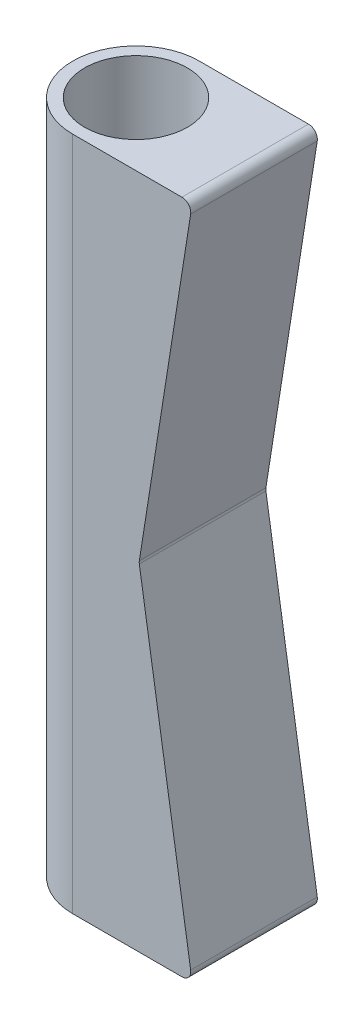
ISO-10303-21;
HEADER;
FILE_DESCRIPTION(('STEP AP214'),'2;1');
FILE_NAME('part.step','',(''),(''),'','','');
FILE_SCHEMA(('AUTOMOTIVE_DESIGN { 1 0 10303 214 1 1 1 1 }'));
ENDSEC;
DATA;
#1=APPLICATION_CONTEXT('core data for automotive mechanical design processes');
#2=APPLICATION_PROTOCOL_DEFINITION('international standard','automotive_design',2000,#1);
#3=PRODUCT_CONTEXT('',#1,'mechanical');
#4=PRODUCT('Part','Part','',(#3));
#5=PRODUCT_RELATED_PRODUCT_CATEGORY('part','',(#4));
#6=PRODUCT_DEFINITION_FORMATION('','',#4);
#7=PRODUCT_DEFINITION_CONTEXT('part definition',#1,'design');
#8=PRODUCT_DEFINITION('design','',#6,#7);
#9=PRODUCT_DEFINITION_SHAPE('','',#8);
#10=(LENGTH_UNIT() NAMED_UNIT(*) SI_UNIT(.MILLI.,.METRE.));
#11=(NAMED_UNIT(*) PLANE_ANGLE_UNIT() SI_UNIT($,.RADIAN.));
#12=(NAMED_UNIT(*) SI_UNIT($,.STERADIAN.) SOLID_ANGLE_UNIT());
#13=UNCERTAINTY_MEASURE_WITH_UNIT(LENGTH_MEASURE(1.E-05),#10,'distance_accuracy_value','');
#14=(GEOMETRIC_REPRESENTATION_CONTEXT(3) GLOBAL_UNCERTAINTY_ASSIGNED_CONTEXT((#13)) GLOBAL_UNIT_ASSIGNED_CONTEXT((#10,
#11,#12)) REPRESENTATION_CONTEXT('',''));
#15=CARTESIAN_POINT('',(0.,0.,0.));
#16=DIRECTION('',(0.,0.,1.));
#17=DIRECTION('',(1.,0.,0.));
#18=AXIS2_PLACEMENT_3D('',#15,#16,#17);
#19=CARTESIAN_POINT('',(0.,152.4,0.));
#20=DIRECTION('',(0.,-1.,0.));
#21=DIRECTION('',(0.,0.,-1.));
#22=AXIS2_PLACEMENT_3D('',#19,#20,#21);
#23=CYLINDRICAL_SURFACE('',#22,14.2875);
#24=DIRECTION('',(0.,1.,0.));
#25=VECTOR('',#24,1.);
#26=CARTESIAN_POINT('',(0.,0.,14.2875));
#27=LINE('',#26,#25);
#28=CARTESIAN_POINT('',(0.,0.,14.2875));
#29=VERTEX_POINT('',#28);
#30=CARTESIAN_POINT('',(0.,152.4,14.2875));
#31=VERTEX_POINT('',#30);
#32=EDGE_CURVE('E126',#29,#31,#27,.T.);
#33=ORIENTED_EDGE('',*,*,#32,.T.);
#34=CARTESIAN_POINT('',(0.,152.4,0.));
#35=DIRECTION('',(0.,1.,0.));
#36=DIRECTION('',(0.,0.,1.));
#37=AXIS2_PLACEMENT_3D('',#34,#35,#36);
#38=CIRCLE('',#37,14.2875);
#39=CARTESIAN_POINT('',(0.,152.4,-14.2875));
#40=VERTEX_POINT('',#39);
#41=EDGE_CURVE('E124',#40,#31,#38,.T.);
#42=ORIENTED_EDGE('',*,*,#41,.F.);
#43=DIRECTION('',(0.,1.,0.));
#44=VECTOR('',#43,1.);
#45=CARTESIAN_POINT('',(0.,0.,-14.2875));
#46=LINE('',#45,#44);
#47=CARTESIAN_POINT('',(0.,0.,-14.2875));
#48=VERTEX_POINT('',#47);
#49=EDGE_CURVE('E110',#48,#40,#46,.T.);
#50=ORIENTED_EDGE('',*,*,#49,.F.);
#51=CARTESIAN_POINT('',(0.,0.,0.));
#52=DIRECTION('',(0.,1.,0.));
#53=DIRECTION('',(0.,0.,1.));
#54=AXIS2_PLACEMENT_3D('',#51,#52,#53);
#55=CIRCLE('',#54,14.2875);
#56=EDGE_CURVE('E122',#48,#29,#55,.T.);
#57=ORIENTED_EDGE('',*,*,#56,.T.);
#58=EDGE_LOOP('',(#33,#42,#50,#57));
#59=FACE_BOUND('',#58,.T.);
#60=ADVANCED_FACE('F39',(#59),#23,.T.);
#61=CARTESIAN_POINT('',(0.,152.4,0.));
#62=DIRECTION('',(0.,1.,0.));
#63=DIRECTION('',(0.,0.,1.));
#64=AXIS2_PLACEMENT_3D('',#61,#62,#63);
#65=PLANE('',#64);
#66=DIRECTION('',(1.,0.,0.));
#67=VECTOR('',#66,1.);
#68=CARTESIAN_POINT('',(14.2875,152.4,14.2875));
#69=LINE('',#68,#67);
#70=CARTESIAN_POINT('',(24.6478912035075,152.4,14.2875));
#71=VERTEX_POINT('',#70);
#72=EDGE_CURVE('E117',#31,#71,#69,.T.);
#73=ORIENTED_EDGE('',*,*,#72,.T.);
#74=DIRECTION('',(0.,0.,-1.));
#75=VECTOR('',#74,1.);
#76=CARTESIAN_POINT('',(24.6478912035075,152.4,-14.2875));
#77=LINE('',#76,#75);
#78=CARTESIAN_POINT('',(24.6478912035075,152.4,-14.2875));
#79=VERTEX_POINT('',#78);
#80=EDGE_CURVE('E135',#71,#79,#77,.T.);
#81=ORIENTED_EDGE('',*,*,#80,.T.);
#82=DIRECTION('',(-1.,0.,0.));
#83=VECTOR('',#82,1.);
#84=CARTESIAN_POINT('',(14.2875,152.4,-14.2875));
#85=LINE('',#84,#83);
#86=EDGE_CURVE('E196',#79,#40,#85,.T.);
#87=ORIENTED_EDGE('',*,*,#86,.T.);
#88=ORIENTED_EDGE('',*,*,#41,.T.);
#89=EDGE_LOOP('',(#73,#81,#87,#88));
#90=FACE_BOUND('',#89,.T.);
#91=CARTESIAN_POINT('',(0.,152.4,0.));
#92=DIRECTION('',(0.,1.,0.));
#93=DIRECTION('',(0.,0.,1.));
#94=AXIS2_PLACEMENT_3D('',#91,#92,#93);
#95=CIRCLE('',#94,11.6125);
#96=CARTESIAN_POINT('',(0.,152.4,11.6125));
#97=VERTEX_POINT('',#96);
#98=EDGE_CURVE('E131',#97,#97,#95,.T.);
#99=ORIENTED_EDGE('',*,*,#98,.F.);
#100=EDGE_LOOP('',(#99));
#101=FACE_BOUND('',#100,.T.);
#102=ADVANCED_FACE('F224',(#90,#101),#65,.T.);
#103=CARTESIAN_POINT('',(0.,0.,0.));
#104=DIRECTION('',(0.,1.,0.));
#105=DIRECTION('',(0.,0.,1.));
#106=AXIS2_PLACEMENT_3D('',#103,#104,#105);
#107=PLANE('',#106);
#108=DIRECTION('',(-1.,0.,0.));
#109=VECTOR('',#108,1.);
#110=CARTESIAN_POINT('',(26.9875,0.,-14.2875));
#111=LINE('',#110,#109);
#112=CARTESIAN_POINT('',(24.6478912035075,0.,-14.2875));
#113=VERTEX_POINT('',#112);
#114=EDGE_CURVE('E106',#113,#48,#111,.T.);
#115=ORIENTED_EDGE('',*,*,#114,.F.);
#116=DIRECTION('',(0.,0.,-1.));
#117=VECTOR('',#116,1.);
#118=CARTESIAN_POINT('',(24.6478912035075,0.,0.));
#119=LINE('',#118,#117);
#120=CARTESIAN_POINT('',(24.6478912035075,0.,14.2875));
#121=VERTEX_POINT('',#120);
#122=EDGE_CURVE('E55',#113,#121,#119,.F.);
#123=ORIENTED_EDGE('',*,*,#122,.T.);
#124=DIRECTION('',(1.,0.,0.));
#125=VECTOR('',#124,1.);
#126=CARTESIAN_POINT('',(14.2875,0.,14.2875));
#127=LINE('',#126,#125);
#128=EDGE_CURVE('E116',#29,#121,#127,.T.);
#129=ORIENTED_EDGE('',*,*,#128,.F.);
#130=ORIENTED_EDGE('',*,*,#56,.F.);
#131=EDGE_LOOP('',(#115,#123,#129,#130));
#132=FACE_BOUND('',#131,.T.);
#133=CARTESIAN_POINT('',(0.,0.,0.));
#134=DIRECTION('',(0.,1.,0.));
#135=DIRECTION('',(0.,0.,1.));
#136=AXIS2_PLACEMENT_3D('',#133,#134,#135);
#137=CIRCLE('',#136,11.6125);
#138=CARTESIAN_POINT('',(0.,0.,11.6125));
#139=VERTEX_POINT('',#138);
#140=EDGE_CURVE('E138',#139,#139,#137,.T.);
#141=ORIENTED_EDGE('',*,*,#140,.T.);
#142=EDGE_LOOP('',(#141));
#143=FACE_BOUND('',#142,.T.);
#144=ADVANCED_FACE('F128',(#132,#143),#107,.F.);
#145=CARTESIAN_POINT('',(0.,152.4,0.));
#146=DIRECTION('',(0.,-1.,0.));
#147=DIRECTION('',(0.,0.,-1.));
#148=AXIS2_PLACEMENT_3D('',#145,#146,#147);
#149=CYLINDRICAL_SURFACE('',#148,11.6125);
#150=ORIENTED_EDGE('',*,*,#98,.T.);
#151=EDGE_LOOP('',(#150));
#152=FACE_BOUND('',#151,.T.);
#153=ORIENTED_EDGE('',*,*,#140,.F.);
#154=EDGE_LOOP('',(#153));
#155=FACE_BOUND('',#154,.T.);
#156=ADVANCED_FACE('F215',(#152,#155),#149,.F.);
#157=CARTESIAN_POINT('',(14.2875,0.,14.2875));
#158=DIRECTION('',(0.,0.,1.));
#159=DIRECTION('',(1.,0.,0.));
#160=AXIS2_PLACEMENT_3D('',#157,#158,#159);
#161=PLANE('',#160);
#162=DIRECTION('',(-0.155563141844365,-0.987825950711718,0.));
#163=VECTOR('',#162,1.);
#164=CARTESIAN_POINT('',(14.9875,76.2,14.2875));
#165=LINE('',#164,#163);
#166=CARTESIAN_POINT('',(26.6235431049309,150.088873716311,14.2875));
#167=VERTEX_POINT('',#166);
#168=CARTESIAN_POINT('',(15.0364962651478,76.5111262836888,14.2875));
#169=VERTEX_POINT('',#168);
#170=EDGE_CURVE('E174',#167,#169,#165,.T.);
#171=ORIENTED_EDGE('',*,*,#170,.F.);
#172=CARTESIAN_POINT('',(24.6478912035075,150.4,14.2875));
#173=DIRECTION('',(0.,0.,1.));
#174=DIRECTION('',(1.,0.,0.));
#175=AXIS2_PLACEMENT_3D('',#172,#173,#174);
#176=CIRCLE('',#175,2.);
#177=EDGE_CURVE('E158',#167,#71,#176,.T.);
#178=ORIENTED_EDGE('',*,*,#177,.T.);
#179=ORIENTED_EDGE('',*,*,#72,.F.);
#180=ORIENTED_EDGE('',*,*,#32,.F.);
#181=ORIENTED_EDGE('',*,*,#128,.T.);
#182=CARTESIAN_POINT('',(24.6478912035075,2.,14.2875));
#183=DIRECTION('',(0.,0.,1.));
#184=DIRECTION('',(1.,0.,0.));
#185=AXIS2_PLACEMENT_3D('',#182,#183,#184);
#186=CIRCLE('',#185,2.);
#187=CARTESIAN_POINT('',(26.6235431049309,2.31112628368873,14.2875));
#188=VERTEX_POINT('',#187);
#189=EDGE_CURVE('E62',#121,#188,#186,.T.);
#190=ORIENTED_EDGE('',*,*,#189,.T.);
#191=DIRECTION('',(0.155563141844365,-0.987825950711718,0.));
#192=VECTOR('',#191,1.);
#193=CARTESIAN_POINT('',(26.9875,0.,14.2875));
#194=LINE('',#193,#192);
#195=CARTESIAN_POINT('',(15.0364962651478,75.8888737163113,14.2875));
#196=VERTEX_POINT('',#195);
#197=EDGE_CURVE('E176',#196,#188,#194,.T.);
#198=ORIENTED_EDGE('',*,*,#197,.F.);
#199=CARTESIAN_POINT('',(17.0121481665713,76.2,14.2875));
#200=DIRECTION('',(0.,0.,1.));
#201=DIRECTION('',(1.,0.,0.));
#202=AXIS2_PLACEMENT_3D('',#199,#200,#201);
#203=CIRCLE('',#202,2.);
#204=EDGE_CURVE('E48',#196,#169,#203,.F.);
#205=ORIENTED_EDGE('',*,*,#204,.T.);
#206=EDGE_LOOP('',(#171,#178,#179,#180,#181,#190,#198,#205));
#207=FACE_BOUND('',#206,.T.);
#208=ADVANCED_FACE('F173',(#207),#161,.T.);
#209=CARTESIAN_POINT('',(14.2875,0.,-14.2875));
#210=DIRECTION('',(0.,0.,-1.));
#211=DIRECTION('',(-1.,0.,0.));
#212=AXIS2_PLACEMENT_3D('',#209,#210,#211);
#213=PLANE('',#212);
#214=ORIENTED_EDGE('',*,*,#86,.F.);
#215=CARTESIAN_POINT('',(24.6478912035075,150.4,-14.2875));
#216=DIRECTION('',(0.,0.,-1.));
#217=DIRECTION('',(-1.,0.,0.));
#218=AXIS2_PLACEMENT_3D('',#215,#216,#217);
#219=CIRCLE('',#218,2.);
#220=CARTESIAN_POINT('',(26.6235431049309,150.088873716311,-14.2875));
#221=VERTEX_POINT('',#220);
#222=EDGE_CURVE('E147',#79,#221,#219,.T.);
#223=ORIENTED_EDGE('',*,*,#222,.T.);
#224=DIRECTION('',(-0.155563141844365,-0.987825950711718,0.));
#225=VECTOR('',#224,1.);
#226=CARTESIAN_POINT('',(14.9875,76.2,-14.2875));
#227=LINE('',#226,#225);
#228=CARTESIAN_POINT('',(15.0364962651478,76.5111262836888,-14.2875));
#229=VERTEX_POINT('',#228);
#230=EDGE_CURVE('E191',#221,#229,#227,.T.);
#231=ORIENTED_EDGE('',*,*,#230,.T.);
#232=CARTESIAN_POINT('',(17.0121481665713,76.2,-14.2875));
#233=DIRECTION('',(0.,0.,-1.));
#234=DIRECTION('',(-1.,0.,0.));
#235=AXIS2_PLACEMENT_3D('',#232,#233,#234);
#236=CIRCLE('',#235,2.);
#237=CARTESIAN_POINT('',(15.0364962651478,75.8888737163113,-14.2875));
#238=VERTEX_POINT('',#237);
#239=EDGE_CURVE('E11',#229,#238,#236,.F.);
#240=ORIENTED_EDGE('',*,*,#239,.T.);
#241=DIRECTION('',(0.155563141844365,-0.987825950711718,0.));
#242=VECTOR('',#241,1.);
#243=CARTESIAN_POINT('',(26.9875,0.,-14.2875));
#244=LINE('',#243,#242);
#245=CARTESIAN_POINT('',(26.6235431049309,2.31112628368873,-14.2875));
#246=VERTEX_POINT('',#245);
#247=EDGE_CURVE('E190',#238,#246,#244,.T.);
#248=ORIENTED_EDGE('',*,*,#247,.T.);
#249=CARTESIAN_POINT('',(24.6478912035075,2.,-14.2875));
#250=DIRECTION('',(0.,0.,-1.));
#251=DIRECTION('',(-1.,0.,0.));
#252=AXIS2_PLACEMENT_3D('',#249,#250,#251);
#253=CIRCLE('',#252,2.);
#254=EDGE_CURVE('E113',#246,#113,#253,.T.);
#255=ORIENTED_EDGE('',*,*,#254,.T.);
#256=ORIENTED_EDGE('',*,*,#114,.T.);
#257=ORIENTED_EDGE('',*,*,#49,.T.);
#258=EDGE_LOOP('',(#214,#223,#231,#240,#248,#255,#256,#257));
#259=FACE_BOUND('',#258,.T.);
#260=ADVANCED_FACE('F109',(#259),#213,.T.);
#261=CARTESIAN_POINT('',(26.9875,0.,-14.2875));
#262=DIRECTION('',(-0.987825950711718,-0.155563141844365,0.));
#263=DIRECTION('',(0.155563141844365,-0.987825950711718,0.));
#264=AXIS2_PLACEMENT_3D('',#261,#262,#263);
#265=PLANE('',#264);
#266=ORIENTED_EDGE('',*,*,#247,.F.);
#267=DIRECTION('',(0.,0.,1.));
#268=VECTOR('',#267,1.);
#269=CARTESIAN_POINT('',(15.0364962651478,75.8888737163113,14.2875));
#270=LINE('',#269,#268);
#271=EDGE_CURVE('E165',#238,#196,#270,.T.);
#272=ORIENTED_EDGE('',*,*,#271,.T.);
#273=ORIENTED_EDGE('',*,*,#197,.T.);
#274=DIRECTION('',(0.,0.,-1.));
#275=VECTOR('',#274,1.);
#276=CARTESIAN_POINT('',(26.6235431049309,2.31112628368873,-14.2875));
#277=LINE('',#276,#275);
#278=EDGE_CURVE('E161',#188,#246,#277,.T.);
#279=ORIENTED_EDGE('',*,*,#278,.T.);
#280=EDGE_LOOP('',(#266,#272,#273,#279));
#281=FACE_BOUND('',#280,.T.);
#282=ADVANCED_FACE('F193',(#281),#265,.F.);
#283=CARTESIAN_POINT('',(14.9875,76.2,-14.2875));
#284=DIRECTION('',(-0.987825950711718,0.155563141844365,0.));
#285=DIRECTION('',(-0.155563141844365,-0.987825950711718,0.));
#286=AXIS2_PLACEMENT_3D('',#283,#284,#285);
#287=PLANE('',#286);
#288=ORIENTED_EDGE('',*,*,#230,.F.);
#289=DIRECTION('',(0.,0.,-1.));
#290=VECTOR('',#289,1.);
#291=CARTESIAN_POINT('',(26.6235431049309,150.088873716311,14.2875));
#292=LINE('',#291,#290);
#293=EDGE_CURVE('E153',#221,#167,#292,.F.);
#294=ORIENTED_EDGE('',*,*,#293,.T.);
#295=ORIENTED_EDGE('',*,*,#170,.T.);
#296=DIRECTION('',(0.,0.,1.));
#297=VECTOR('',#296,1.);
#298=CARTESIAN_POINT('',(15.0364962651478,76.5111262836888,-14.2875));
#299=LINE('',#298,#297);
#300=EDGE_CURVE('E150',#169,#229,#299,.F.);
#301=ORIENTED_EDGE('',*,*,#300,.T.);
#302=EDGE_LOOP('',(#288,#294,#295,#301));
#303=FACE_BOUND('',#302,.T.);
#304=ADVANCED_FACE('F182',(#303),#287,.F.);
#305=CARTESIAN_POINT('',(24.6478912035075,150.4,0.));
#306=DIRECTION('',(0.,0.,1.));
#307=DIRECTION('',(1.,0.,0.));
#308=AXIS2_PLACEMENT_3D('',#305,#306,#307);
#309=CYLINDRICAL_SURFACE('',#308,2.);
#310=ORIENTED_EDGE('',*,*,#177,.F.);
#311=ORIENTED_EDGE('',*,*,#293,.F.);
#312=ORIENTED_EDGE('',*,*,#222,.F.);
#313=ORIENTED_EDGE('',*,*,#80,.F.);
#314=EDGE_LOOP('',(#310,#311,#312,#313));
#315=FACE_BOUND('',#314,.T.);
#316=ADVANCED_FACE('F235',(#315),#309,.T.);
#317=CARTESIAN_POINT('',(17.0121481665713,76.2,-14.2875));
#318=DIRECTION('',(0.,0.,-1.));
#319=DIRECTION('',(-1.,0.,0.));
#320=AXIS2_PLACEMENT_3D('',#317,#318,#319);
#321=CYLINDRICAL_SURFACE('',#320,2.);
#322=ORIENTED_EDGE('',*,*,#239,.F.);
#323=ORIENTED_EDGE('',*,*,#300,.F.);
#324=ORIENTED_EDGE('',*,*,#204,.F.);
#325=ORIENTED_EDGE('',*,*,#271,.F.);
#326=EDGE_LOOP('',(#322,#323,#324,#325));
#327=FACE_BOUND('',#326,.T.);
#328=ADVANCED_FACE('F188',(#327),#321,.F.);
#329=CARTESIAN_POINT('',(24.6478912035075,2.,-14.2875));
#330=DIRECTION('',(0.,0.,-1.));
#331=DIRECTION('',(-1.,0.,0.));
#332=AXIS2_PLACEMENT_3D('',#329,#330,#331);
#333=CYLINDRICAL_SURFACE('',#332,2.);
#334=ORIENTED_EDGE('',*,*,#189,.F.);
#335=ORIENTED_EDGE('',*,*,#122,.F.);
#336=ORIENTED_EDGE('',*,*,#254,.F.);
#337=ORIENTED_EDGE('',*,*,#278,.F.);
#338=EDGE_LOOP('',(#334,#335,#336,#337));
#339=FACE_BOUND('',#338,.T.);
#340=ADVANCED_FACE('F41',(#339),#333,.T.);
#341=CLOSED_SHELL('',(#60,#102,#144,#156,#208,#260,#282,#304,#316,#328,#340));
#342=MANIFOLD_SOLID_BREP('B2',#341);
#343=ADVANCED_BREP_SHAPE_REPRESENTATION('',(#18,#342),#14);
#344=SHAPE_DEFINITION_REPRESENTATION(#9,#343);
ENDSEC;
END-ISO-10303-21;
